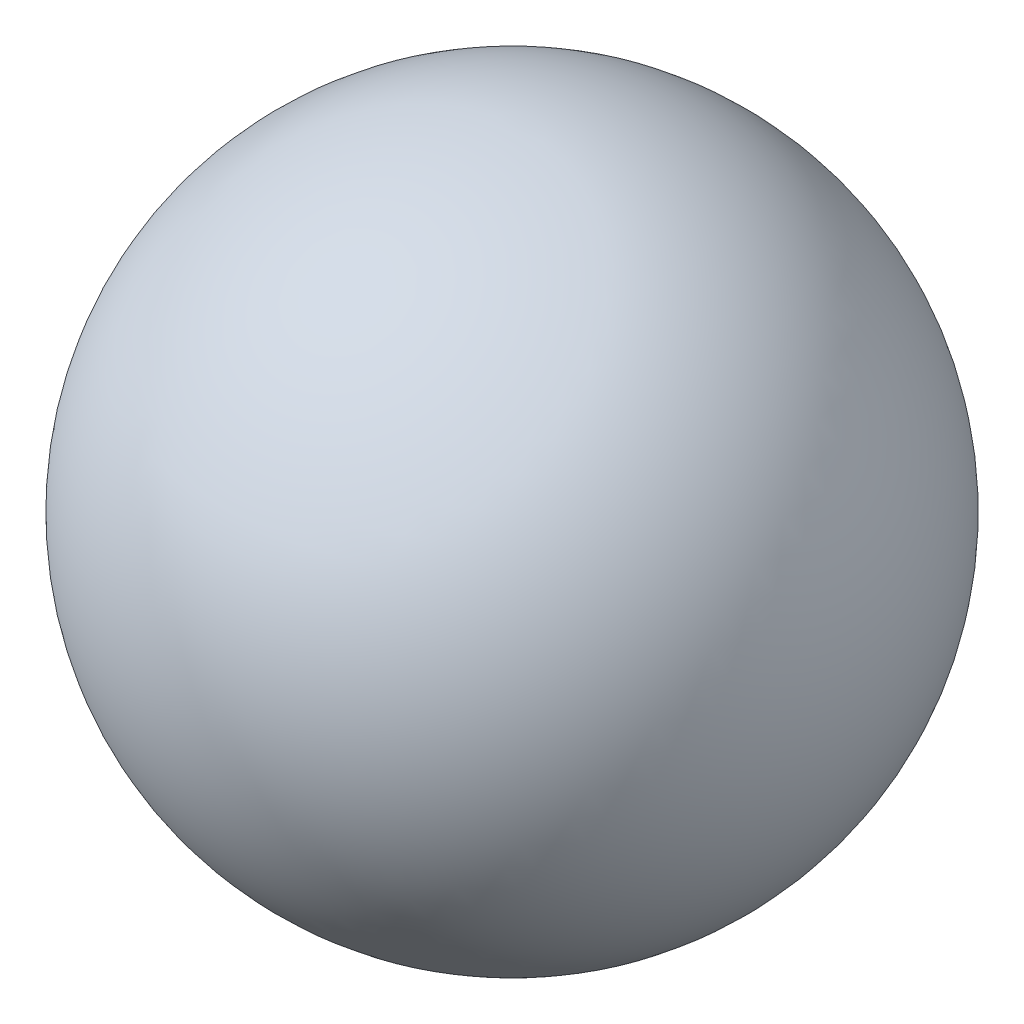
ISO-10303-21;
HEADER;
FILE_DESCRIPTION(('STEP AP214'),'2;1');
FILE_NAME('part.step','',(''),(''),'','','');
FILE_SCHEMA(('AUTOMOTIVE_DESIGN { 1 0 10303 214 1 1 1 1 }'));
ENDSEC;
DATA;
#1=APPLICATION_CONTEXT('core data for automotive mechanical design processes');
#2=APPLICATION_PROTOCOL_DEFINITION('international standard','automotive_design',2000,#1);
#3=PRODUCT_CONTEXT('',#1,'mechanical');
#4=PRODUCT('Part','Part','',(#3));
#5=PRODUCT_RELATED_PRODUCT_CATEGORY('part','',(#4));
#6=PRODUCT_DEFINITION_FORMATION('','',#4);
#7=PRODUCT_DEFINITION_CONTEXT('part definition',#1,'design');
#8=PRODUCT_DEFINITION('design','',#6,#7);
#9=PRODUCT_DEFINITION_SHAPE('','',#8);
#10=(LENGTH_UNIT() NAMED_UNIT(*) SI_UNIT(.MILLI.,.METRE.));
#11=(NAMED_UNIT(*) PLANE_ANGLE_UNIT() SI_UNIT($,.RADIAN.));
#12=(NAMED_UNIT(*) SI_UNIT($,.STERADIAN.) SOLID_ANGLE_UNIT());
#13=UNCERTAINTY_MEASURE_WITH_UNIT(LENGTH_MEASURE(1.E-05),#10,'distance_accuracy_value','');
#14=(GEOMETRIC_REPRESENTATION_CONTEXT(3) GLOBAL_UNCERTAINTY_ASSIGNED_CONTEXT((#13)) GLOBAL_UNIT_ASSIGNED_CONTEXT((#10,
#11,#12)) REPRESENTATION_CONTEXT('',''));
#15=CARTESIAN_POINT('',(0.,0.,0.));
#16=DIRECTION('',(0.,0.,1.));
#17=DIRECTION('',(1.,0.,0.));
#18=AXIS2_PLACEMENT_3D('',#15,#16,#17);
#19=CARTESIAN_POINT('',(0.,0.,0.));
#20=DIRECTION('',(0.,1.,0.));
#21=DIRECTION('',(1.,0.,0.));
#22=AXIS2_PLACEMENT_3D('',#19,#20,#21);
#23=SPHERICAL_SURFACE('',#22,1.8);
#24=CARTESIAN_POINT('',(0.,1.8,0.));
#25=VERTEX_POINT('',#24);
#26=VERTEX_LOOP('',#25);
#27=FACE_BOUND('',#26,.T.);
#28=ADVANCED_FACE('F31',(#27),#23,.T.);
#29=CLOSED_SHELL('',(#28));
#30=MANIFOLD_SOLID_BREP('B2',#29);
#31=ADVANCED_BREP_SHAPE_REPRESENTATION('',(#18,#30),#14);
#32=SHAPE_DEFINITION_REPRESENTATION(#9,#31);
ENDSEC;
END-ISO-10303-21;
